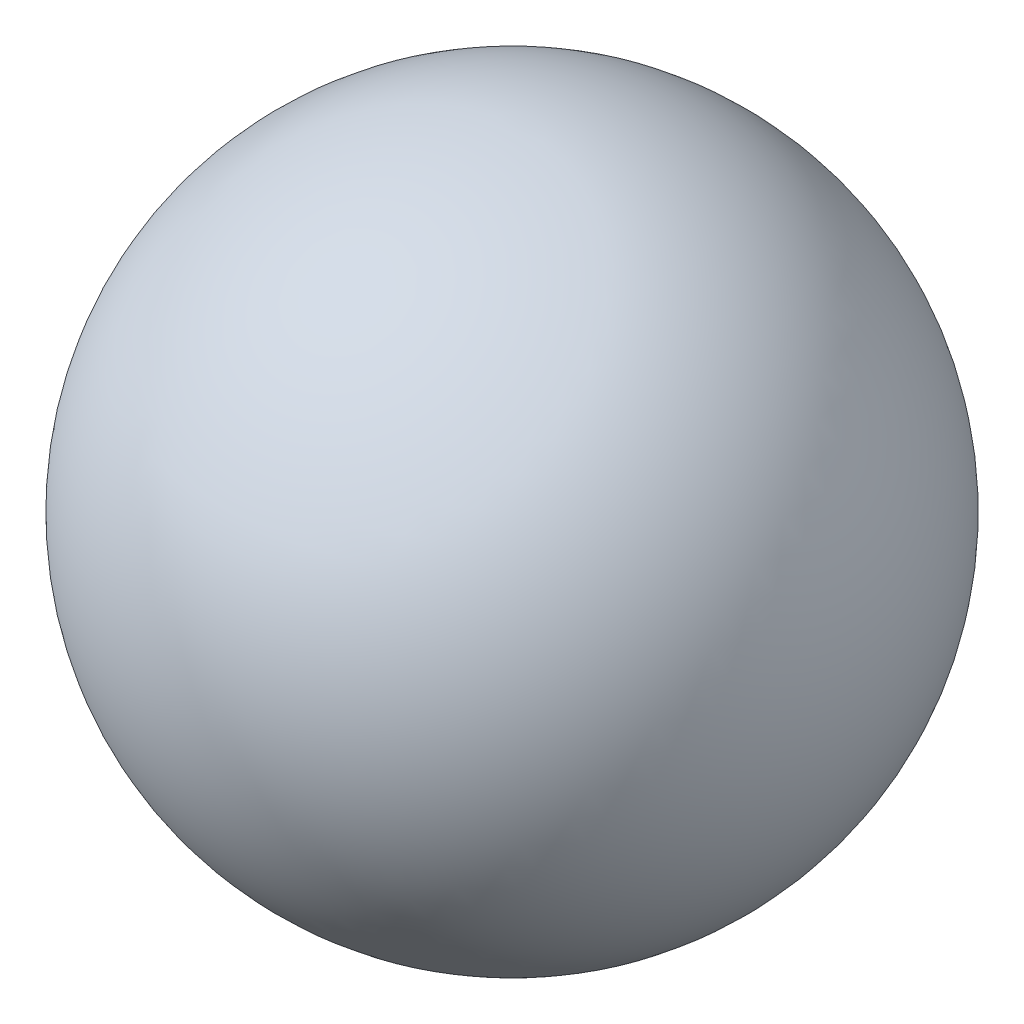
ISO-10303-21;
HEADER;
FILE_DESCRIPTION(('STEP AP214'),'2;1');
FILE_NAME('part.step','',(''),(''),'','','');
FILE_SCHEMA(('AUTOMOTIVE_DESIGN { 1 0 10303 214 1 1 1 1 }'));
ENDSEC;
DATA;
#1=APPLICATION_CONTEXT('core data for automotive mechanical design processes');
#2=APPLICATION_PROTOCOL_DEFINITION('international standard','automotive_design',2000,#1);
#3=PRODUCT_CONTEXT('',#1,'mechanical');
#4=PRODUCT('Part','Part','',(#3));
#5=PRODUCT_RELATED_PRODUCT_CATEGORY('part','',(#4));
#6=PRODUCT_DEFINITION_FORMATION('','',#4);
#7=PRODUCT_DEFINITION_CONTEXT('part definition',#1,'design');
#8=PRODUCT_DEFINITION('design','',#6,#7);
#9=PRODUCT_DEFINITION_SHAPE('','',#8);
#10=(LENGTH_UNIT() NAMED_UNIT(*) SI_UNIT(.MILLI.,.METRE.));
#11=(NAMED_UNIT(*) PLANE_ANGLE_UNIT() SI_UNIT($,.RADIAN.));
#12=(NAMED_UNIT(*) SI_UNIT($,.STERADIAN.) SOLID_ANGLE_UNIT());
#13=UNCERTAINTY_MEASURE_WITH_UNIT(LENGTH_MEASURE(1.E-05),#10,'distance_accuracy_value','');
#14=(GEOMETRIC_REPRESENTATION_CONTEXT(3) GLOBAL_UNCERTAINTY_ASSIGNED_CONTEXT((#13)) GLOBAL_UNIT_ASSIGNED_CONTEXT((#10,
#11,#12)) REPRESENTATION_CONTEXT('',''));
#15=CARTESIAN_POINT('',(0.,0.,0.));
#16=DIRECTION('',(0.,0.,1.));
#17=DIRECTION('',(1.,0.,0.));
#18=AXIS2_PLACEMENT_3D('',#15,#16,#17);
#19=CARTESIAN_POINT('',(0.,0.,0.));
#20=DIRECTION('',(0.,1.,0.));
#21=DIRECTION('',(1.,0.,0.));
#22=AXIS2_PLACEMENT_3D('',#19,#20,#21);
#23=SPHERICAL_SURFACE('',#22,1.995);
#24=CARTESIAN_POINT('',(0.,1.995,0.));
#25=VERTEX_POINT('',#24);
#26=VERTEX_LOOP('',#25);
#27=FACE_BOUND('',#26,.T.);
#28=ADVANCED_FACE('F39',(#27),#23,.T.);
#29=CLOSED_SHELL('',(#28));
#30=MANIFOLD_SOLID_BREP('B2',#29);
#31=ADVANCED_BREP_SHAPE_REPRESENTATION('',(#18,#30),#14);
#32=SHAPE_DEFINITION_REPRESENTATION(#9,#31);
ENDSEC;
END-ISO-10303-21;
